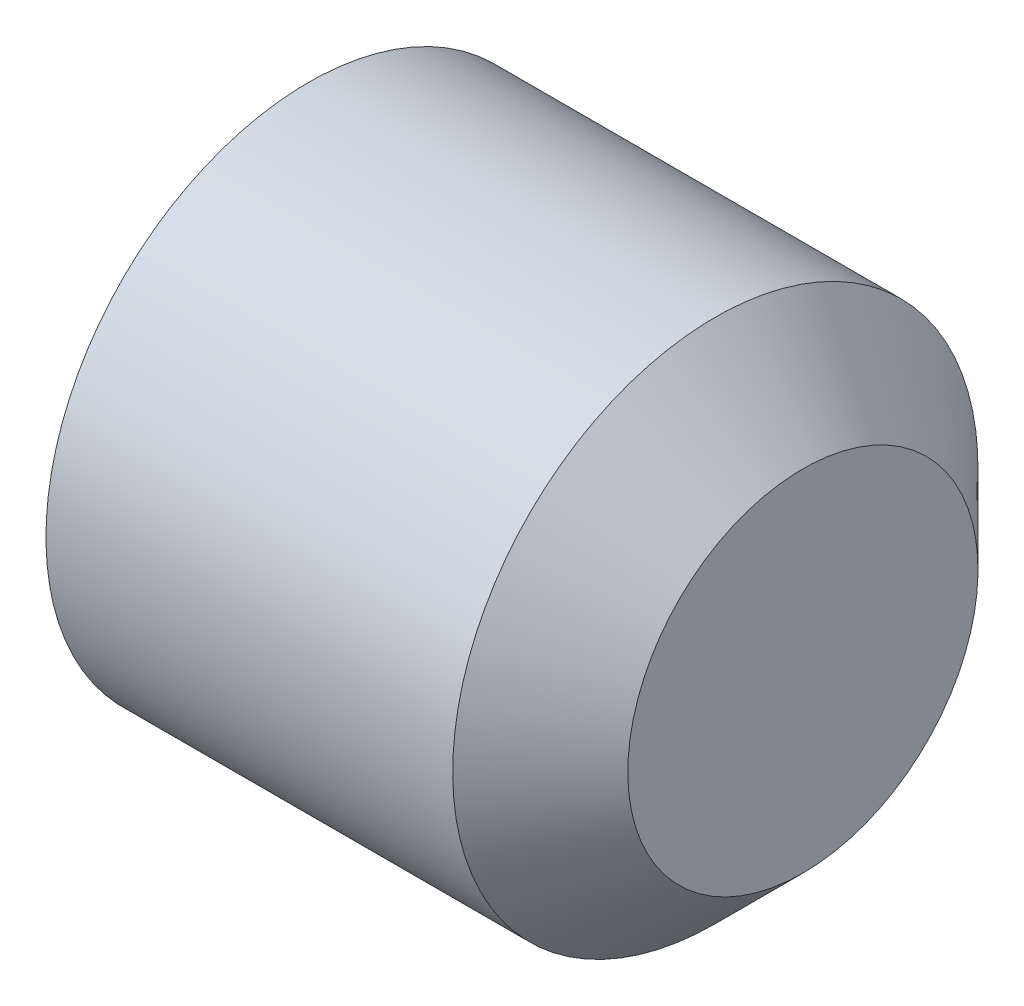
ISO-10303-21;
HEADER;
FILE_DESCRIPTION(('STEP AP214'),'2;1');
FILE_NAME('part.step','',(''),(''),'','','');
FILE_SCHEMA(('AUTOMOTIVE_DESIGN { 1 0 10303 214 1 1 1 1 }'));
ENDSEC;
DATA;
#1=APPLICATION_CONTEXT('core data for automotive mechanical design processes');
#2=APPLICATION_PROTOCOL_DEFINITION('international standard','automotive_design',2000,#1);
#3=PRODUCT_CONTEXT('',#1,'mechanical');
#4=PRODUCT('Part','Part','',(#3));
#5=PRODUCT_RELATED_PRODUCT_CATEGORY('part','',(#4));
#6=PRODUCT_DEFINITION_FORMATION('','',#4);
#7=PRODUCT_DEFINITION_CONTEXT('part definition',#1,'design');
#8=PRODUCT_DEFINITION('design','',#6,#7);
#9=PRODUCT_DEFINITION_SHAPE('','',#8);
#10=(LENGTH_UNIT() NAMED_UNIT(*) SI_UNIT(.MILLI.,.METRE.));
#11=(NAMED_UNIT(*) PLANE_ANGLE_UNIT() SI_UNIT($,.RADIAN.));
#12=(NAMED_UNIT(*) SI_UNIT($,.STERADIAN.) SOLID_ANGLE_UNIT());
#13=UNCERTAINTY_MEASURE_WITH_UNIT(LENGTH_MEASURE(1.E-05),#10,'distance_accuracy_value','');
#14=(GEOMETRIC_REPRESENTATION_CONTEXT(3) GLOBAL_UNCERTAINTY_ASSIGNED_CONTEXT((#13)) GLOBAL_UNIT_ASSIGNED_CONTEXT((#10,
#11,#12)) REPRESENTATION_CONTEXT('',''));
#15=CARTESIAN_POINT('',(0.,0.,0.));
#16=DIRECTION('',(0.,0.,1.));
#17=DIRECTION('',(1.,0.,0.));
#18=AXIS2_PLACEMENT_3D('',#15,#16,#17);
#19=CARTESIAN_POINT('',(1.,0.,0.));
#20=DIRECTION('',(-1.,0.,0.));
#21=DIRECTION('',(0.,-1.,0.));
#22=AXIS2_PLACEMENT_3D('',#19,#20,#21);
#23=CONICAL_SURFACE('',#22,0.,1.0471975511966);
#24=CARTESIAN_POINT('',(0.,0.,0.));
#25=DIRECTION('',(-1.,0.,0.));
#26=DIRECTION('',(0.,-1.,0.));
#27=AXIS2_PLACEMENT_3D('',#24,#25,#26);
#28=CIRCLE('',#27,1.7320508075689);
#29=CARTESIAN_POINT('',(0.,0.,1.7320508075689));
#30=VERTEX_POINT('',#29);
#31=CARTESIAN_POINT('',(0.,1.50000000000004,0.866025403784419));
#32=VERTEX_POINT('',#31);
#33=EDGE_CURVE('E135',#30,#32,#28,.T.);
#34=ORIENTED_EDGE('',*,*,#33,.T.);
#35=CARTESIAN_POINT('',(-6.6673332876768E-05,1.5002,0.865909933730602));
#36=CARTESIAN_POINT('',(0.0219171434463949,1.43428070889745,0.903968454193448));
#37=CARTESIAN_POINT('',(0.0419111105337496,1.36779241087777,0.942355490953075));
#38=CARTESIAN_POINT('',(0.0768118990310639,1.23366433933493,1.01979436916422));
#39=CARTESIAN_POINT('',(0.091706371892403,1.16602218135312,1.05884758728359));
#40=CARTESIAN_POINT('',(0.114893318905326,1.03157622213016,1.13646999803242));
#41=CARTESIAN_POINT('',(0.123340088503754,0.964793115072755,1.17502724286933));
#42=CARTESIAN_POINT('',(0.133426422703714,0.830912431610123,1.25232329150578));
#43=CARTESIAN_POINT('',(0.135074336857676,0.763815342295626,1.29106181408334));
#44=CARTESIAN_POINT('',(0.131658377162461,0.638425268170809,1.36345580713302));
#45=CARTESIAN_POINT('',(0.127433240991585,0.580113576780184,1.3971220778543));
#46=CARTESIAN_POINT('',(0.114038224782893,0.46387012046122,1.46423526865158));
#47=CARTESIAN_POINT('',(0.104863762599716,0.405938758031217,1.49768195634507));
#48=CARTESIAN_POINT('',(0.0819268162605681,0.28945534866085,1.56493368410118));
#49=CARTESIAN_POINT('',(0.0680670380541163,0.230918055453309,1.59873020609218));
#50=CARTESIAN_POINT('',(0.0366102159789058,0.114716876613641,1.66581898797542));
#51=CARTESIAN_POINT('',(0.0190205703259461,0.0570515005961898,1.69911210834202));
#52=CARTESIAN_POINT('',(-6.66733328894787E-05,-0.000200000000000027,1.73216627762274));
#53=B_SPLINE_CURVE_WITH_KNOTS('',3,(#35,#36,#37,#38,#39,#40,#41,#42,#43,#44,#45,#46,#47,#48,#49,
#50,#51,#52),.UNSPECIFIED.,.F.,.F.,(4,2,2,2,2,2,2,2,4),(0.,0.237777822177383,0.476127422841918,
0.708577067230589,0.940741159251579,1.14294352835891,1.34533342091876,1.55221450553908,
1.75868901573749),.UNSPECIFIED.);
#54=EDGE_CURVE('E11',#32,#30,#53,.T.);
#55=ORIENTED_EDGE('',*,*,#54,.T.);
#56=EDGE_LOOP('',(#34,#55));
#57=FACE_BOUND('',#56,.T.);
#58=ADVANCED_FACE('F32',(#57),#23,.F.);
#59=CARTESIAN_POINT('',(0.,-1.5,0.86602540378444));
#60=VERTEX_POINT('',#59);
#61=EDGE_CURVE('E131',#60,#30,#28,.T.);
#62=ORIENTED_EDGE('',*,*,#61,.T.);
#63=CARTESIAN_POINT('',(-6.6673332889421E-05,0.000199999999999979,1.73216627762274));
#64=CARTESIAN_POINT('',(0.0219171434463832,-0.065719291102548,1.69410775715989));
#65=CARTESIAN_POINT('',(0.0419111105337391,-0.132207589122236,1.65572072040026));
#66=CARTESIAN_POINT('',(0.076811899031056,-0.266335660665071,1.57828184218912));
#67=CARTESIAN_POINT('',(0.0917063718923965,-0.333977818646887,1.53922862406975));
#68=CARTESIAN_POINT('',(0.114893318905321,-0.468423777869845,1.46160621332092));
#69=CARTESIAN_POINT('',(0.12334008850375,-0.53520688492725,1.423048968484));
#70=CARTESIAN_POINT('',(0.133426422703713,-0.669087568389883,1.34575291984756));
#71=CARTESIAN_POINT('',(0.135074336857676,-0.736184657704382,1.30701439726999));
#72=CARTESIAN_POINT('',(0.131658377162463,-0.861574731829199,1.23462040422032));
#73=CARTESIAN_POINT('',(0.127433240991588,-0.919886423219822,1.20095413349904));
#74=CARTESIAN_POINT('',(0.114038224782898,-1.03612987953879,1.13384094270175));
#75=CARTESIAN_POINT('',(0.104863762599722,-1.09406124196879,1.10039425500827));
#76=CARTESIAN_POINT('',(0.0819268162605763,-1.21054465133915,1.03314252725216));
#77=CARTESIAN_POINT('',(0.0680670380541256,-1.26908194454669,0.999346005261155));
#78=CARTESIAN_POINT('',(0.036610215978917,-1.38528312338636,0.932257223377919));
#79=CARTESIAN_POINT('',(0.0190205703259583,-1.44294849940381,0.898964103011323));
#80=CARTESIAN_POINT('',(-6.66733328764005E-05,-1.5002,0.865909933730602));
#81=B_SPLINE_CURVE_WITH_KNOTS('',3,(#63,#64,#65,#66,#67,#68,#69,#70,#71,#72,#73,#74,#75,#76,#77,
#78,#79,#80),.UNSPECIFIED.,.F.,.F.,(4,2,2,2,2,2,2,2,4),(0.,0.237777822177386,0.476127422841924,
0.708577067230598,0.940741159251591,1.14294352835891,1.34533342091877,1.55221450553908,
1.75868901573749),.UNSPECIFIED.);
#82=EDGE_CURVE('E46',#30,#60,#81,.T.);
#83=ORIENTED_EDGE('',*,*,#82,.T.);
#84=EDGE_LOOP('',(#62,#83));
#85=FACE_BOUND('',#84,.T.);
#86=ADVANCED_FACE('F206',(#85),#23,.F.);
#87=CARTESIAN_POINT('',(0.,-1.5,-0.86602540378444));
#88=VERTEX_POINT('',#87);
#89=EDGE_CURVE('E130',#88,#60,#28,.T.);
#90=ORIENTED_EDGE('',*,*,#89,.T.);
#91=CARTESIAN_POINT('',(-0.557752933109191,-1.5,-2.24271768215062));
#92=CARTESIAN_POINT('',(-0.526676206224732,-1.5,-2.17794242733976));
#93=CARTESIAN_POINT('',(-0.495922346445976,-1.5,-2.1130095044019));
#94=CARTESIAN_POINT('',(-0.435243312988105,-1.5,-1.98274395237044));
#95=CARTESIAN_POINT('',(-0.40531828844425,-1.5,-1.91741125389286));
#96=CARTESIAN_POINT('',(-0.346312700046034,-1.5,-1.78588718127383));
#97=CARTESIAN_POINT('',(-0.317238359864898,-1.5,-1.71969300240869));
#98=CARTESIAN_POINT('',(-0.260394085187166,-1.5,-1.58675026270829));
#99=CARTESIAN_POINT('',(-0.232624082867124,-1.5,-1.52000173091134));
#100=CARTESIAN_POINT('',(-0.17802553628269,-1.5,-1.38408099810924));
#101=CARTESIAN_POINT('',(-0.151240579090936,-1.5,-1.31489105258371));
#102=CARTESIAN_POINT('',(-0.0999065726951257,-1.5,-1.17568930059673));
#103=CARTESIAN_POINT('',(-0.0753578036652843,-1.5,-1.1056773923879));
#104=CARTESIAN_POINT('',(-0.00610108537408903,-1.5,-0.894522630301177));
#105=CARTESIAN_POINT('',(0.0343797419647254,-1.5,-0.751874326050678));
#106=CARTESIAN_POINT('',(0.0813355118072081,-1.5,-0.535047700412376));
#107=CARTESIAN_POINT('',(0.0946871272592743,-1.5,-0.462365640221034));
#108=CARTESIAN_POINT('',(0.115886577281907,-1.5,-0.316183910454652));
#109=CARTESIAN_POINT('',(0.123734783783319,-1.5,-0.242684296472561));
#110=CARTESIAN_POINT('',(0.133201462749895,-1.5,-0.0961589362171847));
#111=CARTESIAN_POINT('',(0.134893450490373,-1.5,-0.023138063713973));
#112=CARTESIAN_POINT('',(0.132100574535402,-1.5,0.122783079260703));
#113=CARTESIAN_POINT('',(0.127615328367858,-1.5,0.195683341984627));
#114=CARTESIAN_POINT('',(0.109322366315523,-1.5,0.37555391911071));
#115=CARTESIAN_POINT('',(0.0920865017542922,-1.5,0.482175667555592));
#116=CARTESIAN_POINT('',(0.0476401802104245,-1.5,0.69334577748019));
#117=CARTESIAN_POINT('',(0.0204177014506956,-1.5,0.797891479277424));
#118=CARTESIAN_POINT('',(-0.0260849446025812,-1.5,0.954251071806745));
#119=CARTESIAN_POINT('',(-0.0427475343972254,-1.5,1.00687320410971));
#120=CARTESIAN_POINT('',(-0.0776140989665743,-1.5,1.11156970650931));
#121=CARTESIAN_POINT('',(-0.0958171117980088,-1.5,1.16364439595333));
#122=CARTESIAN_POINT('',(-0.133500161154767,-1.5,1.26731560306245));
#123=CARTESIAN_POINT('',(-0.152979965600731,-1.5,1.31891220569288));
#124=CARTESIAN_POINT('',(-0.193005892843671,-1.5,1.42169884730407));
#125=CARTESIAN_POINT('',(-0.213552195799306,-1.5,1.47288881589895));
#126=CARTESIAN_POINT('',(-0.267313665712929,-1.5,1.60355339461359));
#127=CARTESIAN_POINT('',(-0.30116315833162,-1.5,1.68276673443783));
#128=CARTESIAN_POINT('',(-0.370493886027824,-1.5,1.84047808903308));
#129=CARTESIAN_POINT('',(-0.405975243346004,-1.5,1.9189760496866));
#130=CARTESIAN_POINT('',(-0.514291861232093,-1.5,2.15363522546689));
#131=CARTESIAN_POINT('',(-0.588988563117208,-1.5,2.3089355228526));
#132=CARTESIAN_POINT('',(-0.741514733787221,-1.5,2.61820933626908));
#133=CARTESIAN_POINT('',(-0.819347940924922,-1.5,2.77218098653008));
#134=CARTESIAN_POINT('',(-0.977015697332448,-1.5,3.07906936046558));
#135=CARTESIAN_POINT('',(-1.05684999221209,-1.5,3.23198621511177));
#136=CARTESIAN_POINT('',(-1.21029683917429,-1.5,3.52269097334795));
#137=CARTESIAN_POINT('',(-1.28378541530962,-1.5,3.66054454478385));
#138=CARTESIAN_POINT('',(-1.4315998938077,-1.5,3.93580825378712));
#139=CARTESIAN_POINT('',(-1.50592582715774,-1.5,4.07321837470045));
#140=CARTESIAN_POINT('',(-1.65501518548666,-1.5,4.34734790019876));
#141=CARTESIAN_POINT('',(-1.72977701683844,-1.5,4.4840681726605));
#142=CARTESIAN_POINT('',(-1.87978726995951,-1.5,4.75723230229825));
#143=CARTESIAN_POINT('',(-1.95503566605961,-1.5,4.89367617356531));
#144=CARTESIAN_POINT('',(-2.03046248651996,-1.5,5.03002074017741));
#145=B_SPLINE_CURVE_WITH_KNOTS('',3,(#91,#92,#93,#94,#95,#96,#97,#98,#99,#100,#101,#102,#103,
#104,#105,#106,#107,#108,#109,#110,#111,#112,#113,#114,#115,#116,#117,#118,#119,#120,#121,#122,
#123,#124,#125,#126,#127,#128,#129,#130,#131,#132,#133,#134,#135,#136,#137,#138,#139,#140,#141,
#142,#143,#144),.UNSPECIFIED.,.F.,.F.,(4,2,2,2,2,2,2,2,2,2,2,2,2,2,2,2,2,2,2,2,2,2,2,2,2,2,4),
(0.,0.215535511604385,0.431109556594983,0.647991281388111,0.864861716171062,1.08740133691197,
1.3099688016206,1.75384817545401,1.97537465297245,2.1968861578669,2.41574360885129,
2.6346146113107,2.9579675734708,3.28171106856829,3.44728442970754,3.61275514813739,
3.77819587231579,3.94366463516206,4.20206568130721,4.46048611553468,4.97741233836111,
5.49497404006554,6.01247027664338,6.48112210038188,6.94979132441907,7.41726847476586,
7.88472116090936),.UNSPECIFIED.);
#146=EDGE_CURVE('E180',#60,#88,#145,.F.);
#147=ORIENTED_EDGE('',*,*,#146,.T.);
#148=EDGE_LOOP('',(#90,#147));
#149=FACE_BOUND('',#148,.T.);
#150=ADVANCED_FACE('F212',(#149),#23,.F.);
#151=CARTESIAN_POINT('',(0.,0.,-1.7320508075689));
#152=VERTEX_POINT('',#151);
#153=EDGE_CURVE('E234',#152,#88,#28,.T.);
#154=ORIENTED_EDGE('',*,*,#153,.T.);
#155=CARTESIAN_POINT('',(-6.6673332876602E-05,-1.5002,-0.865909933730602));
#156=CARTESIAN_POINT('',(0.021917143446395,-1.43428070889745,-0.903968454193448));
#157=CARTESIAN_POINT('',(0.0419111105337498,-1.36779241087777,-0.942355490953075));
#158=CARTESIAN_POINT('',(0.0768118990310644,-1.23366433933493,-1.01979436916422));
#159=CARTESIAN_POINT('',(0.0917063718924036,-1.16602218135312,-1.05884758728359));
#160=CARTESIAN_POINT('',(0.114893318905326,-1.03157622213016,-1.13646999803242));
#161=CARTESIAN_POINT('',(0.123340088503754,-0.964793115072755,-1.17502724286933));
#162=CARTESIAN_POINT('',(0.133426422703714,-0.830912431610123,-1.25232329150578));
#163=CARTESIAN_POINT('',(0.135074336857676,-0.763815342295626,-1.29106181408334));
#164=CARTESIAN_POINT('',(0.131658377162461,-0.638425268170809,-1.36345580713302));
#165=CARTESIAN_POINT('',(0.127433240991585,-0.580113576780185,-1.3971220778543));
#166=CARTESIAN_POINT('',(0.114038224782893,-0.463870120461221,-1.46423526865158));
#167=CARTESIAN_POINT('',(0.104863762599716,-0.405938758031217,-1.49768195634507));
#168=CARTESIAN_POINT('',(0.0819268162605681,-0.28945534866085,-1.56493368410118));
#169=CARTESIAN_POINT('',(0.0680670380541163,-0.230918055453309,-1.59873020609218));
#170=CARTESIAN_POINT('',(0.0366102159789057,-0.114716876613641,-1.66581898797542));
#171=CARTESIAN_POINT('',(0.019020570325946,-0.0570515005961897,-1.69911210834202));
#172=CARTESIAN_POINT('',(-6.66733328893842E-05,0.000200000000000068,-1.73216627762274));
#173=B_SPLINE_CURVE_WITH_KNOTS('',3,(#155,#156,#157,#158,#159,#160,#161,#162,#163,#164,#165,
#166,#167,#168,#169,#170,#171,#172),.UNSPECIFIED.,.F.,.F.,(4,2,2,2,2,2,2,2,4),(0.,
0.237777822177383,0.476127422841918,0.708577067230589,0.940741159251579,1.14294352835891,
1.34533342091876,1.55221450553908,1.75868901573749),.UNSPECIFIED.);
#174=EDGE_CURVE('E174',#88,#152,#173,.T.);
#175=ORIENTED_EDGE('',*,*,#174,.T.);
#176=EDGE_LOOP('',(#154,#175));
#177=FACE_BOUND('',#176,.T.);
#178=ADVANCED_FACE('F224',(#177),#23,.F.);
#179=CARTESIAN_POINT('',(0.,1.5,-0.86602540378444));
#180=VERTEX_POINT('',#179);
#181=EDGE_CURVE('E232',#180,#152,#28,.T.);
#182=ORIENTED_EDGE('',*,*,#181,.T.);
#183=CARTESIAN_POINT('',(-6.6673332889421E-05,-0.000199999999999979,-1.73216627762274));
#184=CARTESIAN_POINT('',(0.021917143446383,0.065719291102548,-1.69410775715989));
#185=CARTESIAN_POINT('',(0.0419111105337389,0.132207589122236,-1.65572072040026));
#186=CARTESIAN_POINT('',(0.0768118990310559,0.266335660665071,-1.57828184218912));
#187=CARTESIAN_POINT('',(0.0917063718923964,0.333977818646887,-1.53922862406975));
#188=CARTESIAN_POINT('',(0.114893318905321,0.468423777869845,-1.46160621332092));
#189=CARTESIAN_POINT('',(0.12334008850375,0.53520688492725,-1.423048968484));
#190=CARTESIAN_POINT('',(0.133426422703713,0.669087568389883,-1.34575291984756));
#191=CARTESIAN_POINT('',(0.135074336857676,0.736184657704382,-1.30701439726999));
#192=CARTESIAN_POINT('',(0.131658377162463,0.861574731829199,-1.23462040422032));
#193=CARTESIAN_POINT('',(0.127433240991587,0.919886423219822,-1.20095413349904));
#194=CARTESIAN_POINT('',(0.114038224782897,1.03612987953878,-1.13384094270175));
#195=CARTESIAN_POINT('',(0.104863762599721,1.09406124196879,-1.10039425500827));
#196=CARTESIAN_POINT('',(0.081926816260576,1.21054465133915,-1.03314252725216));
#197=CARTESIAN_POINT('',(0.0680670380541252,1.26908194454669,-0.999346005261155));
#198=CARTESIAN_POINT('',(0.0366102159789166,1.38528312338636,-0.932257223377919));
#199=CARTESIAN_POINT('',(0.0190205703259579,1.44294849940381,-0.898964103011323));
#200=CARTESIAN_POINT('',(-6.66733328767238E-05,1.5002,-0.865909933730602));
#201=B_SPLINE_CURVE_WITH_KNOTS('',3,(#183,#184,#185,#186,#187,#188,#189,#190,#191,#192,#193,
#194,#195,#196,#197,#198,#199,#200),.UNSPECIFIED.,.F.,.F.,(4,2,2,2,2,2,2,2,4),(0.,
0.237777822177386,0.476127422841924,0.708577067230598,0.940741159251591,1.14294352835891,
1.34533342091877,1.55221450553908,1.75868901573749),.UNSPECIFIED.);
#202=EDGE_CURVE('E113',#152,#180,#201,.T.);
#203=ORIENTED_EDGE('',*,*,#202,.T.);
#204=EDGE_LOOP('',(#182,#203));
#205=FACE_BOUND('',#204,.T.);
#206=ADVANCED_FACE('F216',(#205),#23,.F.);
#207=EDGE_CURVE('E228',#32,#180,#28,.T.);
#208=ORIENTED_EDGE('',*,*,#207,.T.);
#209=CARTESIAN_POINT('',(-0.557752933109192,1.5,-2.24271768215062));
#210=CARTESIAN_POINT('',(-0.526676206224732,1.5,-2.17794242733976));
#211=CARTESIAN_POINT('',(-0.495922346445976,1.5,-2.1130095044019));
#212=CARTESIAN_POINT('',(-0.435243312988106,1.5,-1.98274395237044));
#213=CARTESIAN_POINT('',(-0.405318288444251,1.5,-1.91741125389286));
#214=CARTESIAN_POINT('',(-0.346312700046035,1.5,-1.78588718127383));
#215=CARTESIAN_POINT('',(-0.317238359864898,1.5,-1.71969300240869));
#216=CARTESIAN_POINT('',(-0.260394085187166,1.5,-1.58675026270829));
#217=CARTESIAN_POINT('',(-0.232624082867124,1.5,-1.52000173091134));
#218=CARTESIAN_POINT('',(-0.17802553628269,1.5,-1.38408099810924));
#219=CARTESIAN_POINT('',(-0.151240579090937,1.5,-1.31489105258371));
#220=CARTESIAN_POINT('',(-0.0999065726951263,1.5,-1.17568930059673));
#221=CARTESIAN_POINT('',(-0.0753578036652846,1.5,-1.1056773923879));
#222=CARTESIAN_POINT('',(-0.00610108537408909,1.5,-0.894522630301178));
#223=CARTESIAN_POINT('',(0.0343797419647251,1.5,-0.751874326050678));
#224=CARTESIAN_POINT('',(0.0813355118072076,1.5,-0.535047700412376));
#225=CARTESIAN_POINT('',(0.0946871272592737,1.5,-0.462365640221034));
#226=CARTESIAN_POINT('',(0.115886577281906,1.5,-0.316183910454651));
#227=CARTESIAN_POINT('',(0.123734783783318,1.5,-0.24268429647256));
#228=CARTESIAN_POINT('',(0.133201462749895,1.5,-0.096158936217184));
#229=CARTESIAN_POINT('',(0.134893450490373,1.5,-0.0231380637139721));
#230=CARTESIAN_POINT('',(0.132100574535401,1.5,0.122783079260704));
#231=CARTESIAN_POINT('',(0.127615328367857,1.5,0.195683341984627));
#232=CARTESIAN_POINT('',(0.109322366315522,1.5,0.375553919110711));
#233=CARTESIAN_POINT('',(0.0920865017542917,1.5,0.482175667555592));
#234=CARTESIAN_POINT('',(0.0476401802104239,1.5,0.693345777480191));
#235=CARTESIAN_POINT('',(0.0204177014506951,1.5,0.797891479277425));
#236=CARTESIAN_POINT('',(-0.0260849446025818,1.5,0.954251071806746));
#237=CARTESIAN_POINT('',(-0.0427475343972259,1.5,1.00687320410971));
#238=CARTESIAN_POINT('',(-0.0776140989665748,1.5,1.11156970650931));
#239=CARTESIAN_POINT('',(-0.0958171117980093,1.5,1.16364439595333));
#240=CARTESIAN_POINT('',(-0.133500161154768,1.5,1.26731560306245));
#241=CARTESIAN_POINT('',(-0.152979965600732,1.5,1.31891220569288));
#242=CARTESIAN_POINT('',(-0.193005892843671,1.5,1.42169884730407));
#243=CARTESIAN_POINT('',(-0.213552195799306,1.5,1.47288881589895));
#244=CARTESIAN_POINT('',(-0.26731366571293,1.5,1.60355339461359));
#245=CARTESIAN_POINT('',(-0.30116315833162,1.5,1.68276673443784));
#246=CARTESIAN_POINT('',(-0.370493886027825,1.5,1.84047808903308));
#247=CARTESIAN_POINT('',(-0.405975243346005,1.5,1.9189760496866));
#248=CARTESIAN_POINT('',(-0.514291861232094,1.5,2.15363522546689));
#249=CARTESIAN_POINT('',(-0.588988563117209,1.5,2.3089355228526));
#250=CARTESIAN_POINT('',(-0.741514733787222,1.5,2.61820933626908));
#251=CARTESIAN_POINT('',(-0.819347940924923,1.5,2.77218098653009));
#252=CARTESIAN_POINT('',(-0.977015697332449,1.5,3.07906936046558));
#253=CARTESIAN_POINT('',(-1.05684999221209,1.5,3.23198621511177));
#254=CARTESIAN_POINT('',(-1.21029683917429,1.5,3.52269097334795));
#255=CARTESIAN_POINT('',(-1.28378541530962,1.5,3.66054454478386));
#256=CARTESIAN_POINT('',(-1.43159989380771,1.5,3.93580825378712));
#257=CARTESIAN_POINT('',(-1.50592582715774,1.5,4.07321837470045));
#258=CARTESIAN_POINT('',(-1.65501518548666,1.5,4.34734790019876));
#259=CARTESIAN_POINT('',(-1.72977701683844,1.5,4.4840681726605));
#260=CARTESIAN_POINT('',(-1.87978726995951,1.5,4.75723230229825));
#261=CARTESIAN_POINT('',(-1.95503566605961,1.5,4.89367617356531));
#262=CARTESIAN_POINT('',(-2.03046248651996,1.5,5.03002074017741));
#263=B_SPLINE_CURVE_WITH_KNOTS('',3,(#209,#210,#211,#212,#213,#214,#215,#216,#217,#218,#219,
#220,#221,#222,#223,#224,#225,#226,#227,#228,#229,#230,#231,#232,#233,#234,#235,#236,#237,#238,
#239,#240,#241,#242,#243,#244,#245,#246,#247,#248,#249,#250,#251,#252,#253,#254,#255,#256,#257,
#258,#259,#260,#261,#262),.UNSPECIFIED.,.F.,.F.,(4,2,2,2,2,2,2,2,2,2,2,2,2,2,2,2,2,2,2,2,2,2,2,
2,2,2,4),(0.,0.215535511604385,0.431109556594983,0.647991281388111,0.864861716171061,
1.08740133691197,1.30996880162061,1.75384817545401,1.97537465297245,2.1968861578669,
2.4157436088513,2.6346146113107,2.9579675734708,3.2817110685683,3.44728442970754,
3.6127551481374,3.7781958723158,3.94366463516206,4.20206568130722,4.46048611553469,
4.97741233836112,5.49497404006555,6.01247027664338,6.48112210038188,6.94979132441907,
7.41726847476586,7.88472116090937),.UNSPECIFIED.);
#264=EDGE_CURVE('E79',#180,#32,#263,.T.);
#265=ORIENTED_EDGE('',*,*,#264,.T.);
#266=EDGE_LOOP('',(#208,#265));
#267=FACE_BOUND('',#266,.T.);
#268=ADVANCED_FACE('F208',(#267),#23,.F.);
#269=CARTESIAN_POINT('',(6.,0.,0.));
#270=DIRECTION('',(1.,0.,0.));
#271=DIRECTION('',(0.,1.,0.));
#272=AXIS2_PLACEMENT_3D('',#269,#270,#271);
#273=PLANE('',#272);
#274=CARTESIAN_POINT('',(6.,0.,0.));
#275=DIRECTION('',(-1.,0.,0.));
#276=DIRECTION('',(0.,-1.,0.));
#277=AXIS2_PLACEMENT_3D('',#274,#275,#276);
#278=CIRCLE('',#277,2.);
#279=CARTESIAN_POINT('',(6.,-2.,0.));
#280=VERTEX_POINT('',#279);
#281=EDGE_CURVE('E144',#280,#280,#278,.T.);
#282=ORIENTED_EDGE('',*,*,#281,.F.);
#283=EDGE_LOOP('',(#282));
#284=FACE_BOUND('',#283,.T.);
#285=ADVANCED_FACE('F34',(#284),#273,.T.);
#286=CARTESIAN_POINT('',(5.,0.,0.));
#287=DIRECTION('',(-1.,0.,0.));
#288=DIRECTION('',(0.,-1.,0.));
#289=AXIS2_PLACEMENT_3D('',#286,#287,#288);
#290=CONICAL_SURFACE('',#289,3.,0.785398163397448);
#291=ORIENTED_EDGE('',*,*,#281,.T.);
#292=EDGE_LOOP('',(#291));
#293=FACE_BOUND('',#292,.T.);
#294=CARTESIAN_POINT('',(5.,0.,0.));
#295=DIRECTION('',(-1.,0.,0.));
#296=DIRECTION('',(0.,-1.,0.));
#297=AXIS2_PLACEMENT_3D('',#294,#295,#296);
#298=CIRCLE('',#297,3.);
#299=CARTESIAN_POINT('',(5.,-3.,0.));
#300=VERTEX_POINT('',#299);
#301=EDGE_CURVE('E141',#300,#300,#298,.T.);
#302=ORIENTED_EDGE('',*,*,#301,.F.);
#303=EDGE_LOOP('',(#302));
#304=FACE_BOUND('',#303,.T.);
#305=ADVANCED_FACE('F222',(#293,#304),#290,.T.);
#306=CARTESIAN_POINT('',(1.,0.,0.));
#307=DIRECTION('',(-1.,0.,0.));
#308=DIRECTION('',(0.,-1.,0.));
#309=AXIS2_PLACEMENT_3D('',#306,#307,#308);
#310=CYLINDRICAL_SURFACE('',#309,3.);
#311=ORIENTED_EDGE('',*,*,#301,.T.);
#312=EDGE_LOOP('',(#311));
#313=FACE_BOUND('',#312,.T.);
#314=CARTESIAN_POINT('',(0.35420439014784,0.,0.));
#315=DIRECTION('',(-1.,0.,0.));
#316=DIRECTION('',(0.,-1.,0.));
#317=AXIS2_PLACEMENT_3D('',#314,#315,#316);
#318=CIRCLE('',#317,3.);
#319=CARTESIAN_POINT('',(0.35420439014784,-3.,0.));
#320=VERTEX_POINT('',#319);
#321=EDGE_CURVE('E138',#320,#320,#318,.T.);
#322=ORIENTED_EDGE('',*,*,#321,.F.);
#323=EDGE_LOOP('',(#322));
#324=FACE_BOUND('',#323,.T.);
#325=ADVANCED_FACE('F331',(#313,#324),#310,.T.);
#326=CARTESIAN_POINT('',(0.,0.,0.));
#327=DIRECTION('',(1.,0.,0.));
#328=DIRECTION('',(0.,1.,0.));
#329=AXIS2_PLACEMENT_3D('',#326,#327,#328);
#330=CONICAL_SURFACE('',#329,2.3865,1.04719755119659);
#331=ORIENTED_EDGE('',*,*,#321,.T.);
#332=EDGE_LOOP('',(#331));
#333=FACE_BOUND('',#332,.T.);
#334=CARTESIAN_POINT('',(0.,0.,0.));
#335=DIRECTION('',(-1.,0.,0.));
#336=DIRECTION('',(0.,-1.,0.));
#337=AXIS2_PLACEMENT_3D('',#334,#335,#336);
#338=CIRCLE('',#337,2.3865);
#339=CARTESIAN_POINT('',(0.,-2.3865,0.));
#340=VERTEX_POINT('',#339);
#341=EDGE_CURVE('E134',#340,#340,#338,.T.);
#342=ORIENTED_EDGE('',*,*,#341,.F.);
#343=EDGE_LOOP('',(#342));
#344=FACE_BOUND('',#343,.T.);
#345=ADVANCED_FACE('F203',(#333,#344),#330,.T.);
#346=CARTESIAN_POINT('',(0.,-2.3865,0.));
#347=DIRECTION('',(-1.,0.,0.));
#348=DIRECTION('',(0.,-1.,0.));
#349=AXIS2_PLACEMENT_3D('',#346,#347,#348);
#350=PLANE('',#349);
#351=ORIENTED_EDGE('',*,*,#341,.T.);
#352=EDGE_LOOP('',(#351));
#353=FACE_BOUND('',#352,.T.);
#354=ORIENTED_EDGE('',*,*,#61,.F.);
#355=ORIENTED_EDGE('',*,*,#89,.F.);
#356=ORIENTED_EDGE('',*,*,#153,.F.);
#357=ORIENTED_EDGE('',*,*,#181,.F.);
#358=ORIENTED_EDGE('',*,*,#207,.F.);
#359=ORIENTED_EDGE('',*,*,#33,.F.);
#360=EDGE_LOOP('',(#354,#355,#356,#357,#358,#359));
#361=FACE_BOUND('',#360,.T.);
#362=ADVANCED_FACE('F198',(#353,#361),#350,.T.);
#363=CARTESIAN_POINT('',(2.,1.5,0.86602540378444));
#364=DIRECTION('',(0.,-0.500000000000009,-0.866025403784433));
#365=DIRECTION('',(0.,0.866025403784433,-0.500000000000009));
#366=AXIS2_PLACEMENT_3D('',#363,#364,#365);
#367=PLANE('',#366);
#368=DIRECTION('',(-1.,0.,0.));
#369=VECTOR('',#368,1.);
#370=CARTESIAN_POINT('',(2.,1.5,0.86602540378444));
#371=LINE('',#370,#369);
#372=CARTESIAN_POINT('',(2.,1.5,0.86602540378444));
#373=VERTEX_POINT('',#372);
#374=EDGE_CURVE('E53',#373,#32,#371,.T.);
#375=ORIENTED_EDGE('',*,*,#374,.F.);
#376=DIRECTION('',(0.,-0.866025403784433,0.500000000000009));
#377=VECTOR('',#376,1.);
#378=CARTESIAN_POINT('',(2.,1.5,0.86602540378444));
#379=LINE('',#378,#377);
#380=CARTESIAN_POINT('',(2.,0.,1.7320508075689));
#381=VERTEX_POINT('',#380);
#382=EDGE_CURVE('E244',#373,#381,#379,.T.);
#383=ORIENTED_EDGE('',*,*,#382,.T.);
#384=DIRECTION('',(-1.,0.,0.));
#385=VECTOR('',#384,1.);
#386=CARTESIAN_POINT('',(2.,0.,1.7320508075689));
#387=LINE('',#386,#385);
#388=EDGE_CURVE('E127',#381,#30,#387,.T.);
#389=ORIENTED_EDGE('',*,*,#388,.T.);
#390=ORIENTED_EDGE('',*,*,#54,.F.);
#391=EDGE_LOOP('',(#375,#383,#389,#390));
#392=FACE_BOUND('',#391,.T.);
#393=ADVANCED_FACE('F194',(#392),#367,.T.);
#394=CARTESIAN_POINT('',(2.,0.,1.7320508075689));
#395=DIRECTION('',(0.,0.500000000000009,-0.866025403784433));
#396=DIRECTION('',(0.,0.866025403784433,0.500000000000009));
#397=AXIS2_PLACEMENT_3D('',#394,#395,#396);
#398=PLANE('',#397);
#399=ORIENTED_EDGE('',*,*,#388,.F.);
#400=DIRECTION('',(0.,-0.866025403784433,-0.500000000000009));
#401=VECTOR('',#400,1.);
#402=CARTESIAN_POINT('',(2.,0.,1.7320508075689));
#403=LINE('',#402,#401);
#404=CARTESIAN_POINT('',(2.,-1.5,0.86602540378444));
#405=VERTEX_POINT('',#404);
#406=EDGE_CURVE('E88',#381,#405,#403,.T.);
#407=ORIENTED_EDGE('',*,*,#406,.T.);
#408=DIRECTION('',(-1.,0.,0.));
#409=VECTOR('',#408,1.);
#410=CARTESIAN_POINT('',(2.,-1.5,0.86602540378444));
#411=LINE('',#410,#409);
#412=EDGE_CURVE('E124',#405,#60,#411,.T.);
#413=ORIENTED_EDGE('',*,*,#412,.T.);
#414=ORIENTED_EDGE('',*,*,#82,.F.);
#415=EDGE_LOOP('',(#399,#407,#413,#414));
#416=FACE_BOUND('',#415,.T.);
#417=ADVANCED_FACE('F191',(#416),#398,.T.);
#418=CARTESIAN_POINT('',(2.,-1.5,0.86602540378444));
#419=DIRECTION('',(0.,1.,0.));
#420=DIRECTION('',(0.,0.,1.));
#421=AXIS2_PLACEMENT_3D('',#418,#419,#420);
#422=PLANE('',#421);
#423=ORIENTED_EDGE('',*,*,#412,.F.);
#424=DIRECTION('',(0.,0.,-1.));
#425=VECTOR('',#424,1.);
#426=CARTESIAN_POINT('',(2.,-1.5,0.86602540378444));
#427=LINE('',#426,#425);
#428=CARTESIAN_POINT('',(2.,-1.5,-0.86602540378444));
#429=VERTEX_POINT('',#428);
#430=EDGE_CURVE('E108',#405,#429,#427,.T.);
#431=ORIENTED_EDGE('',*,*,#430,.T.);
#432=DIRECTION('',(-1.,0.,0.));
#433=VECTOR('',#432,1.);
#434=CARTESIAN_POINT('',(2.,-1.5,-0.86602540378444));
#435=LINE('',#434,#433);
#436=EDGE_CURVE('E105',#429,#88,#435,.T.);
#437=ORIENTED_EDGE('',*,*,#436,.T.);
#438=ORIENTED_EDGE('',*,*,#146,.F.);
#439=EDGE_LOOP('',(#423,#431,#437,#438));
#440=FACE_BOUND('',#439,.T.);
#441=ADVANCED_FACE('F171',(#440),#422,.T.);
#442=CARTESIAN_POINT('',(2.,-1.5,-0.86602540378444));
#443=DIRECTION('',(0.,0.500000000000009,0.866025403784433));
#444=DIRECTION('',(0.,-0.866025403784433,0.500000000000009));
#445=AXIS2_PLACEMENT_3D('',#442,#443,#444);
#446=PLANE('',#445);
#447=ORIENTED_EDGE('',*,*,#436,.F.);
#448=DIRECTION('',(0.,0.866025403784433,-0.500000000000009));
#449=VECTOR('',#448,1.);
#450=CARTESIAN_POINT('',(2.,-1.5,-0.86602540378444));
#451=LINE('',#450,#449);
#452=CARTESIAN_POINT('',(2.,0.,-1.7320508075689));
#453=VERTEX_POINT('',#452);
#454=EDGE_CURVE('E99',#429,#453,#451,.T.);
#455=ORIENTED_EDGE('',*,*,#454,.T.);
#456=DIRECTION('',(-1.,0.,0.));
#457=VECTOR('',#456,1.);
#458=CARTESIAN_POINT('',(2.,0.,-1.7320508075689));
#459=LINE('',#458,#457);
#460=EDGE_CURVE('E102',#453,#152,#459,.T.);
#461=ORIENTED_EDGE('',*,*,#460,.T.);
#462=ORIENTED_EDGE('',*,*,#174,.F.);
#463=EDGE_LOOP('',(#447,#455,#461,#462));
#464=FACE_BOUND('',#463,.T.);
#465=ADVANCED_FACE('F101',(#464),#446,.T.);
#466=CARTESIAN_POINT('',(2.,0.,-1.7320508075689));
#467=DIRECTION('',(0.,-0.500000000000009,0.866025403784433));
#468=DIRECTION('',(0.,-0.866025403784433,-0.500000000000009));
#469=AXIS2_PLACEMENT_3D('',#466,#467,#468);
#470=PLANE('',#469);
#471=ORIENTED_EDGE('',*,*,#460,.F.);
#472=DIRECTION('',(0.,0.866025403784433,0.500000000000009));
#473=VECTOR('',#472,1.);
#474=CARTESIAN_POINT('',(2.,0.,-1.7320508075689));
#475=LINE('',#474,#473);
#476=CARTESIAN_POINT('',(2.,1.5,-0.86602540378444));
#477=VERTEX_POINT('',#476);
#478=EDGE_CURVE('E107',#453,#477,#475,.T.);
#479=ORIENTED_EDGE('',*,*,#478,.T.);
#480=DIRECTION('',(-1.,0.,0.));
#481=VECTOR('',#480,1.);
#482=CARTESIAN_POINT('',(2.,1.5,-0.86602540378444));
#483=LINE('',#482,#481);
#484=EDGE_CURVE('E114',#477,#180,#483,.T.);
#485=ORIENTED_EDGE('',*,*,#484,.T.);
#486=ORIENTED_EDGE('',*,*,#202,.F.);
#487=EDGE_LOOP('',(#471,#479,#485,#486));
#488=FACE_BOUND('',#487,.T.);
#489=ADVANCED_FACE('F111',(#488),#470,.T.);
#490=CARTESIAN_POINT('',(2.,1.5,-0.86602540378444));
#491=DIRECTION('',(0.,-1.,0.));
#492=DIRECTION('',(0.,0.,-1.));
#493=AXIS2_PLACEMENT_3D('',#490,#491,#492);
#494=PLANE('',#493);
#495=ORIENTED_EDGE('',*,*,#484,.F.);
#496=DIRECTION('',(0.,0.,1.));
#497=VECTOR('',#496,1.);
#498=CARTESIAN_POINT('',(2.,1.5,-0.86602540378444));
#499=LINE('',#498,#497);
#500=EDGE_CURVE('E59',#477,#373,#499,.T.);
#501=ORIENTED_EDGE('',*,*,#500,.T.);
#502=ORIENTED_EDGE('',*,*,#374,.T.);
#503=ORIENTED_EDGE('',*,*,#264,.F.);
#504=EDGE_LOOP('',(#495,#501,#502,#503));
#505=FACE_BOUND('',#504,.T.);
#506=ADVANCED_FACE('F161',(#505),#494,.T.);
#507=CARTESIAN_POINT('',(2.,0.,0.));
#508=DIRECTION('',(1.,0.,0.));
#509=DIRECTION('',(0.,0.,-1.));
#510=AXIS2_PLACEMENT_3D('',#507,#508,#509);
#511=PLANE('',#510);
#512=ORIENTED_EDGE('',*,*,#382,.F.);
#513=ORIENTED_EDGE('',*,*,#500,.F.);
#514=ORIENTED_EDGE('',*,*,#478,.F.);
#515=ORIENTED_EDGE('',*,*,#454,.F.);
#516=ORIENTED_EDGE('',*,*,#430,.F.);
#517=ORIENTED_EDGE('',*,*,#406,.F.);
#518=EDGE_LOOP('',(#512,#513,#514,#515,#516,#517));
#519=FACE_BOUND('',#518,.T.);
#520=ADVANCED_FACE('F116',(#519),#511,.F.);
#521=CLOSED_SHELL('',(#58,#86,#150,#178,#206,#268,#285,#305,#325,#345,#362,#393,#417,#441,#465,
#489,#506,#520));
#522=MANIFOLD_SOLID_BREP('B2',#521);
#523=ADVANCED_BREP_SHAPE_REPRESENTATION('',(#18,#522),#14);
#524=SHAPE_DEFINITION_REPRESENTATION(#9,#523);
ENDSEC;
END-ISO-10303-21;
